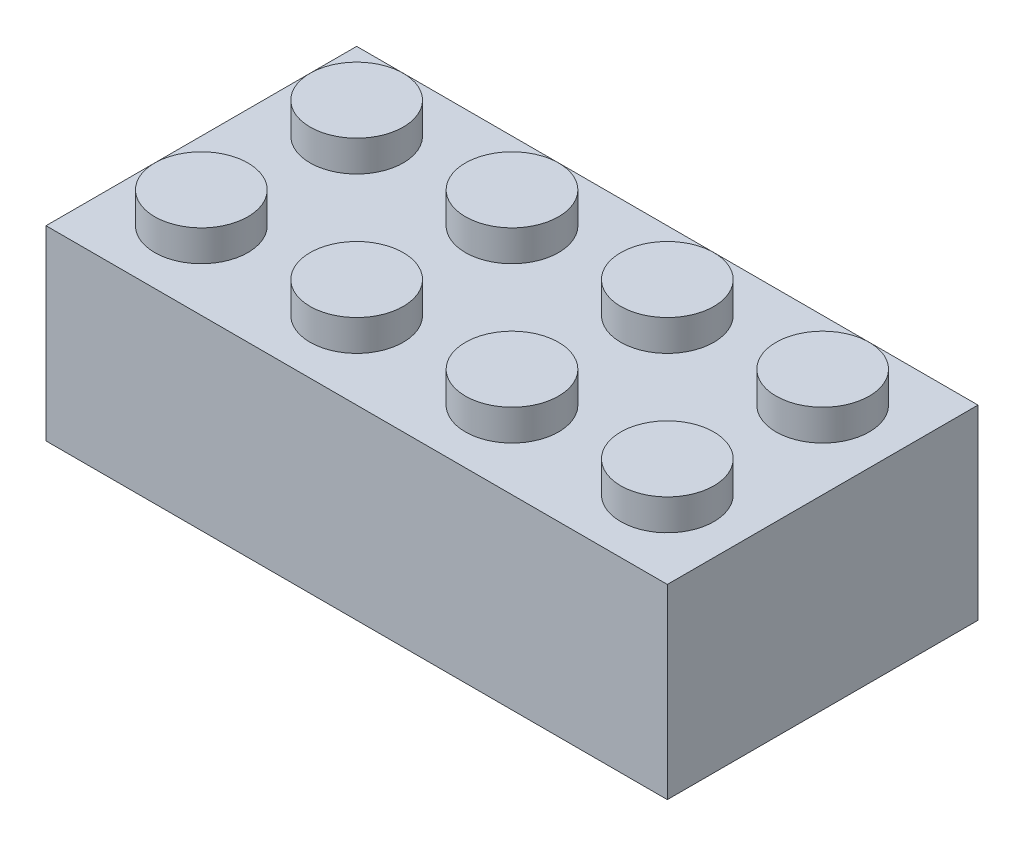
ISO-10303-21;
HEADER;
FILE_DESCRIPTION(('STEP AP214'),'2;1');
FILE_NAME('part.step','',(''),(''),'','','');
FILE_SCHEMA(('AUTOMOTIVE_DESIGN { 1 0 10303 214 1 1 1 1 }'));
ENDSEC;
DATA;
#1=APPLICATION_CONTEXT('core data for automotive mechanical design processes');
#2=APPLICATION_PROTOCOL_DEFINITION('international standard','automotive_design',2000,#1);
#3=PRODUCT_CONTEXT('',#1,'mechanical');
#4=PRODUCT('Part','Part','',(#3));
#5=PRODUCT_RELATED_PRODUCT_CATEGORY('part','',(#4));
#6=PRODUCT_DEFINITION_FORMATION('','',#4);
#7=PRODUCT_DEFINITION_CONTEXT('part definition',#1,'design');
#8=PRODUCT_DEFINITION('design','',#6,#7);
#9=PRODUCT_DEFINITION_SHAPE('','',#8);
#10=(LENGTH_UNIT() NAMED_UNIT(*) SI_UNIT(.MILLI.,.METRE.));
#11=(NAMED_UNIT(*) PLANE_ANGLE_UNIT() SI_UNIT($,.RADIAN.));
#12=(NAMED_UNIT(*) SI_UNIT($,.STERADIAN.) SOLID_ANGLE_UNIT());
#13=UNCERTAINTY_MEASURE_WITH_UNIT(LENGTH_MEASURE(1.E-05),#10,'distance_accuracy_value','');
#14=(GEOMETRIC_REPRESENTATION_CONTEXT(3) GLOBAL_UNCERTAINTY_ASSIGNED_CONTEXT((#13)) GLOBAL_UNIT_ASSIGNED_CONTEXT((#10,
#11,#12)) REPRESENTATION_CONTEXT('',''));
#15=CARTESIAN_POINT('',(0.,0.,0.));
#16=DIRECTION('',(0.,0.,1.));
#17=DIRECTION('',(1.,0.,0.));
#18=AXIS2_PLACEMENT_3D('',#15,#16,#17);
#19=CARTESIAN_POINT('',(-7.5,2.,-2.5));
#20=DIRECTION('',(0.,-1.,0.));
#21=DIRECTION('',(0.,0.,-1.));
#22=AXIS2_PLACEMENT_3D('',#19,#20,#21);
#23=CYLINDRICAL_SURFACE('',#22,1.5);
#24=CARTESIAN_POINT('',(-7.5,1.,-2.5));
#25=DIRECTION('',(0.,1.,0.));
#26=DIRECTION('',(0.,0.,1.));
#27=AXIS2_PLACEMENT_3D('',#24,#25,#26);
#28=CIRCLE('',#27,1.5);
#29=CARTESIAN_POINT('',(-7.5,1.,-1.));
#30=VERTEX_POINT('',#29);
#31=EDGE_CURVE('E307',#30,#30,#28,.T.);
#32=ORIENTED_EDGE('',*,*,#31,.T.);
#33=EDGE_LOOP('',(#32));
#34=FACE_BOUND('',#33,.T.);
#35=CARTESIAN_POINT('',(-7.5,2.,-2.5));
#36=DIRECTION('',(0.,1.,0.));
#37=DIRECTION('',(0.,0.,1.));
#38=AXIS2_PLACEMENT_3D('',#35,#36,#37);
#39=CIRCLE('',#38,1.5);
#40=CARTESIAN_POINT('',(-7.5,2.,-1.));
#41=VERTEX_POINT('',#40);
#42=EDGE_CURVE('E308',#41,#41,#39,.T.);
#43=ORIENTED_EDGE('',*,*,#42,.F.);
#44=EDGE_LOOP('',(#43));
#45=FACE_BOUND('',#44,.T.);
#46=ADVANCED_FACE('F80',(#34,#45),#23,.T.);
#47=CARTESIAN_POINT('',(0.,2.,0.));
#48=DIRECTION('',(0.,1.,0.));
#49=DIRECTION('',(0.,0.,1.));
#50=AXIS2_PLACEMENT_3D('',#47,#48,#49);
#51=PLANE('',#50);
#52=ORIENTED_EDGE('',*,*,#42,.T.);
#53=EDGE_LOOP('',(#52));
#54=FACE_BOUND('',#53,.T.);
#55=ADVANCED_FACE('F347',(#54),#51,.T.);
#56=CARTESIAN_POINT('',(-10.,1.,5.));
#57=DIRECTION('',(0.,0.,-1.));
#58=DIRECTION('',(-1.,0.,0.));
#59=AXIS2_PLACEMENT_3D('',#56,#57,#58);
#60=PLANE('',#59);
#61=DIRECTION('',(0.,-1.,0.));
#62=VECTOR('',#61,1.);
#63=CARTESIAN_POINT('',(-10.,1.,5.));
#64=LINE('',#63,#62);
#65=CARTESIAN_POINT('',(-10.,1.,5.));
#66=VERTEX_POINT('',#65);
#67=CARTESIAN_POINT('',(-10.,-5.,5.));
#68=VERTEX_POINT('',#67);
#69=EDGE_CURVE('E299',#66,#68,#64,.T.);
#70=ORIENTED_EDGE('',*,*,#69,.T.);
#71=DIRECTION('',(1.,0.,0.));
#72=VECTOR('',#71,1.);
#73=CARTESIAN_POINT('',(0.,-5.,5.));
#74=LINE('',#73,#72);
#75=CARTESIAN_POINT('',(10.,-5.,5.));
#76=VERTEX_POINT('',#75);
#77=EDGE_CURVE('E178',#68,#76,#74,.T.);
#78=ORIENTED_EDGE('',*,*,#77,.T.);
#79=DIRECTION('',(0.,-1.,0.));
#80=VECTOR('',#79,1.);
#81=CARTESIAN_POINT('',(10.,1.,5.));
#82=LINE('',#81,#80);
#83=CARTESIAN_POINT('',(10.,1.,5.));
#84=VERTEX_POINT('',#83);
#85=EDGE_CURVE('E305',#84,#76,#82,.T.);
#86=ORIENTED_EDGE('',*,*,#85,.F.);
#87=DIRECTION('',(1.,0.,0.));
#88=VECTOR('',#87,1.);
#89=CARTESIAN_POINT('',(-10.,1.,5.));
#90=LINE('',#89,#88);
#91=EDGE_CURVE('E288',#66,#84,#90,.T.);
#92=ORIENTED_EDGE('',*,*,#91,.F.);
#93=EDGE_LOOP('',(#70,#78,#86,#92));
#94=FACE_BOUND('',#93,.T.);
#95=ADVANCED_FACE('F352',(#94),#60,.F.);
#96=CARTESIAN_POINT('',(10.,1.,5.));
#97=DIRECTION('',(-1.,0.,0.));
#98=DIRECTION('',(0.,0.,1.));
#99=AXIS2_PLACEMENT_3D('',#96,#97,#98);
#100=PLANE('',#99);
#101=ORIENTED_EDGE('',*,*,#85,.T.);
#102=DIRECTION('',(0.,0.,-1.));
#103=VECTOR('',#102,1.);
#104=CARTESIAN_POINT('',(10.,-5.,0.));
#105=LINE('',#104,#103);
#106=CARTESIAN_POINT('',(10.,-5.,-5.));
#107=VERTEX_POINT('',#106);
#108=EDGE_CURVE('E181',#76,#107,#105,.T.);
#109=ORIENTED_EDGE('',*,*,#108,.T.);
#110=DIRECTION('',(0.,-1.,0.));
#111=VECTOR('',#110,1.);
#112=CARTESIAN_POINT('',(10.,1.,-5.));
#113=LINE('',#112,#111);
#114=CARTESIAN_POINT('',(10.,1.,-5.));
#115=VERTEX_POINT('',#114);
#116=EDGE_CURVE('E303',#115,#107,#113,.T.);
#117=ORIENTED_EDGE('',*,*,#116,.F.);
#118=DIRECTION('',(0.,0.,-1.));
#119=VECTOR('',#118,1.);
#120=CARTESIAN_POINT('',(10.,1.,5.));
#121=LINE('',#120,#119);
#122=EDGE_CURVE('E291',#84,#115,#121,.T.);
#123=ORIENTED_EDGE('',*,*,#122,.F.);
#124=EDGE_LOOP('',(#101,#109,#117,#123));
#125=FACE_BOUND('',#124,.T.);
#126=ADVANCED_FACE('F374',(#125),#100,.F.);
#127=CARTESIAN_POINT('',(-10.,1.,-5.));
#128=DIRECTION('',(0.,0.,-1.));
#129=DIRECTION('',(-1.,0.,0.));
#130=AXIS2_PLACEMENT_3D('',#127,#128,#129);
#131=PLANE('',#130);
#132=ORIENTED_EDGE('',*,*,#116,.T.);
#133=DIRECTION('',(1.,0.,0.));
#134=VECTOR('',#133,1.);
#135=CARTESIAN_POINT('',(0.,-5.,-5.));
#136=LINE('',#135,#134);
#137=CARTESIAN_POINT('',(-10.,-5.,-5.));
#138=VERTEX_POINT('',#137);
#139=EDGE_CURVE('E184',#138,#107,#136,.T.);
#140=ORIENTED_EDGE('',*,*,#139,.F.);
#141=DIRECTION('',(0.,-1.,0.));
#142=VECTOR('',#141,1.);
#143=CARTESIAN_POINT('',(-10.,1.,-5.));
#144=LINE('',#143,#142);
#145=CARTESIAN_POINT('',(-10.,1.,-5.));
#146=VERTEX_POINT('',#145);
#147=EDGE_CURVE('E301',#146,#138,#144,.T.);
#148=ORIENTED_EDGE('',*,*,#147,.F.);
#149=DIRECTION('',(1.,0.,0.));
#150=VECTOR('',#149,1.);
#151=CARTESIAN_POINT('',(-10.,1.,-5.));
#152=LINE('',#151,#150);
#153=EDGE_CURVE('E293',#146,#115,#152,.T.);
#154=ORIENTED_EDGE('',*,*,#153,.T.);
#155=EDGE_LOOP('',(#132,#140,#148,#154));
#156=FACE_BOUND('',#155,.T.);
#157=ADVANCED_FACE('F378',(#156),#131,.T.);
#158=CARTESIAN_POINT('',(-10.,1.,5.));
#159=DIRECTION('',(-1.,0.,0.));
#160=DIRECTION('',(0.,0.,1.));
#161=AXIS2_PLACEMENT_3D('',#158,#159,#160);
#162=PLANE('',#161);
#163=ORIENTED_EDGE('',*,*,#147,.T.);
#164=DIRECTION('',(0.,0.,-1.));
#165=VECTOR('',#164,1.);
#166=CARTESIAN_POINT('',(-10.,-5.,0.));
#167=LINE('',#166,#165);
#168=EDGE_CURVE('E164',#68,#138,#167,.T.);
#169=ORIENTED_EDGE('',*,*,#168,.F.);
#170=ORIENTED_EDGE('',*,*,#69,.F.);
#171=DIRECTION('',(0.,0.,-1.));
#172=VECTOR('',#171,1.);
#173=CARTESIAN_POINT('',(-10.,1.,5.));
#174=LINE('',#173,#172);
#175=EDGE_CURVE('E296',#66,#146,#174,.T.);
#176=ORIENTED_EDGE('',*,*,#175,.T.);
#177=EDGE_LOOP('',(#163,#169,#170,#176));
#178=FACE_BOUND('',#177,.T.);
#179=ADVANCED_FACE('F362',(#178),#162,.T.);
#180=CARTESIAN_POINT('',(0.,1.,0.));
#181=DIRECTION('',(0.,1.,0.));
#182=DIRECTION('',(0.,0.,1.));
#183=AXIS2_PLACEMENT_3D('',#180,#181,#182);
#184=PLANE('',#183);
#185=CARTESIAN_POINT('',(-7.49999999999995,1.,2.5));
#186=DIRECTION('',(0.,1.,0.));
#187=DIRECTION('',(0.,0.,1.));
#188=AXIS2_PLACEMENT_3D('',#185,#186,#187);
#189=CIRCLE('',#188,1.5);
#190=CARTESIAN_POINT('',(-7.49999999999995,1.,4.));
#191=VERTEX_POINT('',#190);
#192=EDGE_CURVE('E249',#191,#191,#189,.F.);
#193=ORIENTED_EDGE('',*,*,#192,.T.);
#194=EDGE_LOOP('',(#193));
#195=FACE_BOUND('',#194,.T.);
#196=CARTESIAN_POINT('',(-2.49999999999995,1.,2.5));
#197=DIRECTION('',(0.,1.,0.));
#198=DIRECTION('',(0.,0.,1.));
#199=AXIS2_PLACEMENT_3D('',#196,#197,#198);
#200=CIRCLE('',#199,1.5);
#201=CARTESIAN_POINT('',(-2.49999999999995,1.,4.));
#202=VERTEX_POINT('',#201);
#203=EDGE_CURVE('E255',#202,#202,#200,.F.);
#204=ORIENTED_EDGE('',*,*,#203,.T.);
#205=EDGE_LOOP('',(#204));
#206=FACE_BOUND('',#205,.T.);
#207=CARTESIAN_POINT('',(2.50000000000005,1.,2.5));
#208=DIRECTION('',(0.,1.,0.));
#209=DIRECTION('',(0.,0.,1.));
#210=AXIS2_PLACEMENT_3D('',#207,#208,#209);
#211=CIRCLE('',#210,1.5);
#212=CARTESIAN_POINT('',(2.50000000000005,1.,4.));
#213=VERTEX_POINT('',#212);
#214=EDGE_CURVE('E261',#213,#213,#211,.F.);
#215=ORIENTED_EDGE('',*,*,#214,.T.);
#216=EDGE_LOOP('',(#215));
#217=FACE_BOUND('',#216,.T.);
#218=CARTESIAN_POINT('',(7.50000000000005,1.,2.5));
#219=DIRECTION('',(0.,1.,0.));
#220=DIRECTION('',(0.,0.,1.));
#221=AXIS2_PLACEMENT_3D('',#218,#219,#220);
#222=CIRCLE('',#221,1.5);
#223=CARTESIAN_POINT('',(7.50000000000005,1.,4.));
#224=VERTEX_POINT('',#223);
#225=EDGE_CURVE('E267',#224,#224,#222,.F.);
#226=ORIENTED_EDGE('',*,*,#225,.T.);
#227=EDGE_LOOP('',(#226));
#228=FACE_BOUND('',#227,.T.);
#229=CARTESIAN_POINT('',(7.5,1.,-2.5));
#230=DIRECTION('',(0.,1.,0.));
#231=DIRECTION('',(0.,0.,1.));
#232=AXIS2_PLACEMENT_3D('',#229,#230,#231);
#233=CIRCLE('',#232,1.5);
#234=CARTESIAN_POINT('',(7.5,1.,-1.));
#235=VERTEX_POINT('',#234);
#236=EDGE_CURVE('E273',#235,#235,#233,.F.);
#237=ORIENTED_EDGE('',*,*,#236,.T.);
#238=EDGE_LOOP('',(#237));
#239=FACE_BOUND('',#238,.T.);
#240=CARTESIAN_POINT('',(2.5,1.,-2.5));
#241=DIRECTION('',(0.,1.,0.));
#242=DIRECTION('',(0.,0.,1.));
#243=AXIS2_PLACEMENT_3D('',#240,#241,#242);
#244=CIRCLE('',#243,1.5);
#245=CARTESIAN_POINT('',(2.5,1.,-1.));
#246=VERTEX_POINT('',#245);
#247=EDGE_CURVE('E279',#246,#246,#244,.F.);
#248=ORIENTED_EDGE('',*,*,#247,.T.);
#249=EDGE_LOOP('',(#248));
#250=FACE_BOUND('',#249,.T.);
#251=CARTESIAN_POINT('',(-2.5,1.,-2.5));
#252=DIRECTION('',(0.,1.,0.));
#253=DIRECTION('',(0.,0.,1.));
#254=AXIS2_PLACEMENT_3D('',#251,#252,#253);
#255=CIRCLE('',#254,1.5);
#256=CARTESIAN_POINT('',(-2.5,1.,-1.));
#257=VERTEX_POINT('',#256);
#258=EDGE_CURVE('E285',#257,#257,#255,.F.);
#259=ORIENTED_EDGE('',*,*,#258,.T.);
#260=EDGE_LOOP('',(#259));
#261=FACE_BOUND('',#260,.T.);
#262=ORIENTED_EDGE('',*,*,#31,.F.);
#263=EDGE_LOOP('',(#262));
#264=FACE_BOUND('',#263,.T.);
#265=ORIENTED_EDGE('',*,*,#91,.T.);
#266=ORIENTED_EDGE('',*,*,#122,.T.);
#267=ORIENTED_EDGE('',*,*,#153,.F.);
#268=ORIENTED_EDGE('',*,*,#175,.F.);
#269=EDGE_LOOP('',(#265,#266,#267,#268));
#270=FACE_BOUND('',#269,.T.);
#271=ADVANCED_FACE('F358',(#195,#206,#217,#228,#239,#250,#261,#264,#270),#184,.T.);
#272=CARTESIAN_POINT('',(-2.5,2.,-2.5));
#273=DIRECTION('',(0.,-1.,0.));
#274=DIRECTION('',(0.,0.,-1.));
#275=AXIS2_PLACEMENT_3D('',#272,#273,#274);
#276=CYLINDRICAL_SURFACE('',#275,1.5);
#277=ORIENTED_EDGE('',*,*,#258,.F.);
#278=EDGE_LOOP('',(#277));
#279=FACE_BOUND('',#278,.T.);
#280=CARTESIAN_POINT('',(-2.5,2.,-2.5));
#281=DIRECTION('',(0.,1.,0.));
#282=DIRECTION('',(0.,0.,1.));
#283=AXIS2_PLACEMENT_3D('',#280,#281,#282);
#284=CIRCLE('',#283,1.5);
#285=CARTESIAN_POINT('',(-2.5,2.,-1.));
#286=VERTEX_POINT('',#285);
#287=EDGE_CURVE('E282',#286,#286,#284,.T.);
#288=ORIENTED_EDGE('',*,*,#287,.F.);
#289=EDGE_LOOP('',(#288));
#290=FACE_BOUND('',#289,.T.);
#291=ADVANCED_FACE('F361',(#279,#290),#276,.T.);
#292=CARTESIAN_POINT('',(0.,2.,0.));
#293=DIRECTION('',(0.,1.,0.));
#294=DIRECTION('',(0.,0.,1.));
#295=AXIS2_PLACEMENT_3D('',#292,#293,#294);
#296=PLANE('',#295);
#297=ORIENTED_EDGE('',*,*,#287,.T.);
#298=EDGE_LOOP('',(#297));
#299=FACE_BOUND('',#298,.T.);
#300=ADVANCED_FACE('F819',(#299),#296,.T.);
#301=CARTESIAN_POINT('',(2.5,2.,-2.5));
#302=DIRECTION('',(0.,-1.,0.));
#303=DIRECTION('',(0.,0.,-1.));
#304=AXIS2_PLACEMENT_3D('',#301,#302,#303);
#305=CYLINDRICAL_SURFACE('',#304,1.5);
#306=ORIENTED_EDGE('',*,*,#247,.F.);
#307=EDGE_LOOP('',(#306));
#308=FACE_BOUND('',#307,.T.);
#309=CARTESIAN_POINT('',(2.5,2.,-2.5));
#310=DIRECTION('',(0.,1.,0.));
#311=DIRECTION('',(0.,0.,1.));
#312=AXIS2_PLACEMENT_3D('',#309,#310,#311);
#313=CIRCLE('',#312,1.5);
#314=CARTESIAN_POINT('',(2.5,2.,-1.));
#315=VERTEX_POINT('',#314);
#316=EDGE_CURVE('E276',#315,#315,#313,.T.);
#317=ORIENTED_EDGE('',*,*,#316,.F.);
#318=EDGE_LOOP('',(#317));
#319=FACE_BOUND('',#318,.T.);
#320=ADVANCED_FACE('F811',(#308,#319),#305,.T.);
#321=CARTESIAN_POINT('',(0.,2.,0.));
#322=DIRECTION('',(0.,1.,0.));
#323=DIRECTION('',(0.,0.,1.));
#324=AXIS2_PLACEMENT_3D('',#321,#322,#323);
#325=PLANE('',#324);
#326=ORIENTED_EDGE('',*,*,#316,.T.);
#327=EDGE_LOOP('',(#326));
#328=FACE_BOUND('',#327,.T.);
#329=ADVANCED_FACE('F803',(#328),#325,.T.);
#330=CARTESIAN_POINT('',(7.5,2.,-2.5));
#331=DIRECTION('',(0.,-1.,0.));
#332=DIRECTION('',(0.,0.,-1.));
#333=AXIS2_PLACEMENT_3D('',#330,#331,#332);
#334=CYLINDRICAL_SURFACE('',#333,1.5);
#335=ORIENTED_EDGE('',*,*,#236,.F.);
#336=EDGE_LOOP('',(#335));
#337=FACE_BOUND('',#336,.T.);
#338=CARTESIAN_POINT('',(7.5,2.,-2.5));
#339=DIRECTION('',(0.,1.,0.));
#340=DIRECTION('',(0.,0.,1.));
#341=AXIS2_PLACEMENT_3D('',#338,#339,#340);
#342=CIRCLE('',#341,1.5);
#343=CARTESIAN_POINT('',(7.5,2.,-1.));
#344=VERTEX_POINT('',#343);
#345=EDGE_CURVE('E270',#344,#344,#342,.T.);
#346=ORIENTED_EDGE('',*,*,#345,.F.);
#347=EDGE_LOOP('',(#346));
#348=FACE_BOUND('',#347,.T.);
#349=ADVANCED_FACE('F795',(#337,#348),#334,.T.);
#350=CARTESIAN_POINT('',(0.,2.,0.));
#351=DIRECTION('',(0.,1.,0.));
#352=DIRECTION('',(0.,0.,1.));
#353=AXIS2_PLACEMENT_3D('',#350,#351,#352);
#354=PLANE('',#353);
#355=ORIENTED_EDGE('',*,*,#345,.T.);
#356=EDGE_LOOP('',(#355));
#357=FACE_BOUND('',#356,.T.);
#358=ADVANCED_FACE('F787',(#357),#354,.T.);
#359=CARTESIAN_POINT('',(7.50000000000005,2.,2.5));
#360=DIRECTION('',(0.,-1.,0.));
#361=DIRECTION('',(0.,0.,-1.));
#362=AXIS2_PLACEMENT_3D('',#359,#360,#361);
#363=CYLINDRICAL_SURFACE('',#362,1.5);
#364=ORIENTED_EDGE('',*,*,#225,.F.);
#365=EDGE_LOOP('',(#364));
#366=FACE_BOUND('',#365,.T.);
#367=CARTESIAN_POINT('',(7.50000000000005,2.,2.5));
#368=DIRECTION('',(0.,1.,0.));
#369=DIRECTION('',(0.,0.,1.));
#370=AXIS2_PLACEMENT_3D('',#367,#368,#369);
#371=CIRCLE('',#370,1.5);
#372=CARTESIAN_POINT('',(7.50000000000005,2.,4.));
#373=VERTEX_POINT('',#372);
#374=EDGE_CURVE('E264',#373,#373,#371,.T.);
#375=ORIENTED_EDGE('',*,*,#374,.F.);
#376=EDGE_LOOP('',(#375));
#377=FACE_BOUND('',#376,.T.);
#378=ADVANCED_FACE('F779',(#366,#377),#363,.T.);
#379=CARTESIAN_POINT('',(0.,2.,0.));
#380=DIRECTION('',(0.,1.,0.));
#381=DIRECTION('',(0.,0.,1.));
#382=AXIS2_PLACEMENT_3D('',#379,#380,#381);
#383=PLANE('',#382);
#384=ORIENTED_EDGE('',*,*,#374,.T.);
#385=EDGE_LOOP('',(#384));
#386=FACE_BOUND('',#385,.T.);
#387=ADVANCED_FACE('F771',(#386),#383,.T.);
#388=CARTESIAN_POINT('',(2.50000000000005,2.,2.5));
#389=DIRECTION('',(0.,-1.,0.));
#390=DIRECTION('',(0.,0.,-1.));
#391=AXIS2_PLACEMENT_3D('',#388,#389,#390);
#392=CYLINDRICAL_SURFACE('',#391,1.5);
#393=ORIENTED_EDGE('',*,*,#214,.F.);
#394=EDGE_LOOP('',(#393));
#395=FACE_BOUND('',#394,.T.);
#396=CARTESIAN_POINT('',(2.50000000000005,2.,2.5));
#397=DIRECTION('',(0.,1.,0.));
#398=DIRECTION('',(0.,0.,1.));
#399=AXIS2_PLACEMENT_3D('',#396,#397,#398);
#400=CIRCLE('',#399,1.5);
#401=CARTESIAN_POINT('',(2.50000000000005,2.,4.));
#402=VERTEX_POINT('',#401);
#403=EDGE_CURVE('E258',#402,#402,#400,.T.);
#404=ORIENTED_EDGE('',*,*,#403,.F.);
#405=EDGE_LOOP('',(#404));
#406=FACE_BOUND('',#405,.T.);
#407=ADVANCED_FACE('F763',(#395,#406),#392,.T.);
#408=CARTESIAN_POINT('',(0.,2.,0.));
#409=DIRECTION('',(0.,1.,0.));
#410=DIRECTION('',(0.,0.,1.));
#411=AXIS2_PLACEMENT_3D('',#408,#409,#410);
#412=PLANE('',#411);
#413=ORIENTED_EDGE('',*,*,#403,.T.);
#414=EDGE_LOOP('',(#413));
#415=FACE_BOUND('',#414,.T.);
#416=ADVANCED_FACE('F755',(#415),#412,.T.);
#417=CARTESIAN_POINT('',(-2.49999999999995,2.,2.5));
#418=DIRECTION('',(0.,-1.,0.));
#419=DIRECTION('',(0.,0.,-1.));
#420=AXIS2_PLACEMENT_3D('',#417,#418,#419);
#421=CYLINDRICAL_SURFACE('',#420,1.5);
#422=ORIENTED_EDGE('',*,*,#203,.F.);
#423=EDGE_LOOP('',(#422));
#424=FACE_BOUND('',#423,.T.);
#425=CARTESIAN_POINT('',(-2.49999999999995,2.,2.5));
#426=DIRECTION('',(0.,1.,0.));
#427=DIRECTION('',(0.,0.,1.));
#428=AXIS2_PLACEMENT_3D('',#425,#426,#427);
#429=CIRCLE('',#428,1.5);
#430=CARTESIAN_POINT('',(-2.49999999999995,2.,4.));
#431=VERTEX_POINT('',#430);
#432=EDGE_CURVE('E252',#431,#431,#429,.T.);
#433=ORIENTED_EDGE('',*,*,#432,.F.);
#434=EDGE_LOOP('',(#433));
#435=FACE_BOUND('',#434,.T.);
#436=ADVANCED_FACE('F747',(#424,#435),#421,.T.);
#437=CARTESIAN_POINT('',(0.,2.,0.));
#438=DIRECTION('',(0.,1.,0.));
#439=DIRECTION('',(0.,0.,1.));
#440=AXIS2_PLACEMENT_3D('',#437,#438,#439);
#441=PLANE('',#440);
#442=ORIENTED_EDGE('',*,*,#432,.T.);
#443=EDGE_LOOP('',(#442));
#444=FACE_BOUND('',#443,.T.);
#445=ADVANCED_FACE('F739',(#444),#441,.T.);
#446=CARTESIAN_POINT('',(-7.49999999999995,2.,2.5));
#447=DIRECTION('',(0.,-1.,0.));
#448=DIRECTION('',(0.,0.,-1.));
#449=AXIS2_PLACEMENT_3D('',#446,#447,#448);
#450=CYLINDRICAL_SURFACE('',#449,1.5);
#451=ORIENTED_EDGE('',*,*,#192,.F.);
#452=EDGE_LOOP('',(#451));
#453=FACE_BOUND('',#452,.T.);
#454=CARTESIAN_POINT('',(-7.49999999999995,2.,2.5));
#455=DIRECTION('',(0.,1.,0.));
#456=DIRECTION('',(0.,0.,1.));
#457=AXIS2_PLACEMENT_3D('',#454,#455,#456);
#458=CIRCLE('',#457,1.5);
#459=CARTESIAN_POINT('',(-7.49999999999995,2.,4.));
#460=VERTEX_POINT('',#459);
#461=EDGE_CURVE('E244',#460,#460,#458,.T.);
#462=ORIENTED_EDGE('',*,*,#461,.F.);
#463=EDGE_LOOP('',(#462));
#464=FACE_BOUND('',#463,.T.);
#465=ADVANCED_FACE('F732',(#453,#464),#450,.T.);
#466=CARTESIAN_POINT('',(0.,2.,0.));
#467=DIRECTION('',(0.,1.,0.));
#468=DIRECTION('',(0.,0.,1.));
#469=AXIS2_PLACEMENT_3D('',#466,#467,#468);
#470=PLANE('',#469);
#471=ORIENTED_EDGE('',*,*,#461,.T.);
#472=EDGE_LOOP('',(#471));
#473=FACE_BOUND('',#472,.T.);
#474=ADVANCED_FACE('F422',(#473),#470,.T.);
#475=CARTESIAN_POINT('',(9.00000000000001,-5.,0.));
#476=DIRECTION('',(1.,0.,0.));
#477=DIRECTION('',(0.,0.,-1.));
#478=AXIS2_PLACEMENT_3D('',#475,#476,#477);
#479=PLANE('',#478);
#480=DIRECTION('',(0.,0.,-1.));
#481=VECTOR('',#480,1.);
#482=CARTESIAN_POINT('',(9.00000000000001,0.,0.));
#483=LINE('',#482,#481);
#484=CARTESIAN_POINT('',(9.00000000000001,0.,4.));
#485=VERTEX_POINT('',#484);
#486=CARTESIAN_POINT('',(9.00000000000001,0.,-4.));
#487=VERTEX_POINT('',#486);
#488=EDGE_CURVE('E189',#485,#487,#483,.T.);
#489=ORIENTED_EDGE('',*,*,#488,.T.);
#490=DIRECTION('',(0.,1.,0.));
#491=VECTOR('',#490,1.);
#492=CARTESIAN_POINT('',(9.00000000000001,-5.,-4.));
#493=LINE('',#492,#491);
#494=CARTESIAN_POINT('',(9.00000000000001,-5.,-4.));
#495=VERTEX_POINT('',#494);
#496=EDGE_CURVE('E167',#495,#487,#493,.T.);
#497=ORIENTED_EDGE('',*,*,#496,.F.);
#498=DIRECTION('',(0.,0.,-1.));
#499=VECTOR('',#498,1.);
#500=CARTESIAN_POINT('',(9.00000000000001,-5.,0.));
#501=LINE('',#500,#499);
#502=CARTESIAN_POINT('',(9.00000000000001,-5.,4.));
#503=VERTEX_POINT('',#502);
#504=EDGE_CURVE('E149',#503,#495,#501,.T.);
#505=ORIENTED_EDGE('',*,*,#504,.F.);
#506=DIRECTION('',(0.,1.,0.));
#507=VECTOR('',#506,1.);
#508=CARTESIAN_POINT('',(9.00000000000001,-5.,4.));
#509=LINE('',#508,#507);
#510=EDGE_CURVE('E158',#503,#485,#509,.T.);
#511=ORIENTED_EDGE('',*,*,#510,.T.);
#512=EDGE_LOOP('',(#489,#497,#505,#511));
#513=FACE_BOUND('',#512,.T.);
#514=ADVANCED_FACE('F166',(#513),#479,.F.);
#515=CARTESIAN_POINT('',(0.,-5.,-4.));
#516=DIRECTION('',(0.,0.,1.));
#517=DIRECTION('',(1.,0.,0.));
#518=AXIS2_PLACEMENT_3D('',#515,#516,#517);
#519=PLANE('',#518);
#520=DIRECTION('',(1.,0.,0.));
#521=VECTOR('',#520,1.);
#522=CARTESIAN_POINT('',(0.,0.,-4.));
#523=LINE('',#522,#521);
#524=CARTESIAN_POINT('',(-9.,0.,-4.));
#525=VERTEX_POINT('',#524);
#526=EDGE_CURVE('E94',#525,#487,#523,.T.);
#527=ORIENTED_EDGE('',*,*,#526,.F.);
#528=DIRECTION('',(0.,1.,0.));
#529=VECTOR('',#528,1.);
#530=CARTESIAN_POINT('',(-9.,-5.,-4.));
#531=LINE('',#530,#529);
#532=CARTESIAN_POINT('',(-9.,-5.,-4.));
#533=VERTEX_POINT('',#532);
#534=EDGE_CURVE('E196',#533,#525,#531,.T.);
#535=ORIENTED_EDGE('',*,*,#534,.F.);
#536=DIRECTION('',(1.,0.,0.));
#537=VECTOR('',#536,1.);
#538=CARTESIAN_POINT('',(0.,-5.,-4.));
#539=LINE('',#538,#537);
#540=EDGE_CURVE('E176',#533,#495,#539,.T.);
#541=ORIENTED_EDGE('',*,*,#540,.T.);
#542=ORIENTED_EDGE('',*,*,#496,.T.);
#543=EDGE_LOOP('',(#527,#535,#541,#542));
#544=FACE_BOUND('',#543,.T.);
#545=ADVANCED_FACE('F421',(#544),#519,.T.);
#546=CARTESIAN_POINT('',(-9.,-5.,0.));
#547=DIRECTION('',(1.,0.,0.));
#548=DIRECTION('',(0.,0.,-1.));
#549=AXIS2_PLACEMENT_3D('',#546,#547,#548);
#550=PLANE('',#549);
#551=DIRECTION('',(0.,0.,-1.));
#552=VECTOR('',#551,1.);
#553=CARTESIAN_POINT('',(-9.,0.,0.));
#554=LINE('',#553,#552);
#555=CARTESIAN_POINT('',(-9.,0.,4.));
#556=VERTEX_POINT('',#555);
#557=EDGE_CURVE('E99',#556,#525,#554,.T.);
#558=ORIENTED_EDGE('',*,*,#557,.F.);
#559=DIRECTION('',(0.,1.,0.));
#560=VECTOR('',#559,1.);
#561=CARTESIAN_POINT('',(-9.,-5.,4.));
#562=LINE('',#561,#560);
#563=CARTESIAN_POINT('',(-9.,-5.,4.));
#564=VERTEX_POINT('',#563);
#565=EDGE_CURVE('E163',#564,#556,#562,.T.);
#566=ORIENTED_EDGE('',*,*,#565,.F.);
#567=DIRECTION('',(0.,0.,-1.));
#568=VECTOR('',#567,1.);
#569=CARTESIAN_POINT('',(-9.,-5.,0.));
#570=LINE('',#569,#568);
#571=EDGE_CURVE('E152',#564,#533,#570,.T.);
#572=ORIENTED_EDGE('',*,*,#571,.T.);
#573=ORIENTED_EDGE('',*,*,#534,.T.);
#574=EDGE_LOOP('',(#558,#566,#572,#573));
#575=FACE_BOUND('',#574,.T.);
#576=ADVANCED_FACE('F431',(#575),#550,.T.);
#577=CARTESIAN_POINT('',(0.,-5.,4.));
#578=DIRECTION('',(0.,0.,1.));
#579=DIRECTION('',(1.,0.,0.));
#580=AXIS2_PLACEMENT_3D('',#577,#578,#579);
#581=PLANE('',#580);
#582=DIRECTION('',(1.,0.,0.));
#583=VECTOR('',#582,1.);
#584=CARTESIAN_POINT('',(0.,0.,4.));
#585=LINE('',#584,#583);
#586=EDGE_CURVE('E160',#556,#485,#585,.T.);
#587=ORIENTED_EDGE('',*,*,#586,.T.);
#588=ORIENTED_EDGE('',*,*,#510,.F.);
#589=DIRECTION('',(1.,0.,0.));
#590=VECTOR('',#589,1.);
#591=CARTESIAN_POINT('',(0.,-5.,4.));
#592=LINE('',#591,#590);
#593=EDGE_CURVE('E143',#564,#503,#592,.T.);
#594=ORIENTED_EDGE('',*,*,#593,.F.);
#595=ORIENTED_EDGE('',*,*,#565,.T.);
#596=EDGE_LOOP('',(#587,#588,#594,#595));
#597=FACE_BOUND('',#596,.T.);
#598=ADVANCED_FACE('F159',(#597),#581,.F.);
#599=CARTESIAN_POINT('',(0.,-5.,0.));
#600=DIRECTION('',(0.,1.,0.));
#601=DIRECTION('',(0.,0.,1.));
#602=AXIS2_PLACEMENT_3D('',#599,#600,#601);
#603=PLANE('',#602);
#604=ORIENTED_EDGE('',*,*,#504,.T.);
#605=ORIENTED_EDGE('',*,*,#540,.F.);
#606=ORIENTED_EDGE('',*,*,#571,.F.);
#607=ORIENTED_EDGE('',*,*,#593,.T.);
#608=EDGE_LOOP('',(#604,#605,#606,#607));
#609=FACE_BOUND('',#608,.T.);
#610=ORIENTED_EDGE('',*,*,#77,.F.);
#611=ORIENTED_EDGE('',*,*,#168,.T.);
#612=ORIENTED_EDGE('',*,*,#139,.T.);
#613=ORIENTED_EDGE('',*,*,#108,.F.);
#614=EDGE_LOOP('',(#610,#611,#612,#613));
#615=FACE_BOUND('',#614,.T.);
#616=ADVANCED_FACE('F145',(#609,#615),#603,.F.);
#617=CARTESIAN_POINT('',(0.,1.,0.));
#618=DIRECTION('',(0.,1.,0.));
#619=DIRECTION('',(0.,0.,1.));
#620=AXIS2_PLACEMENT_3D('',#617,#618,#619);
#621=PLANE('',#620);
#622=CARTESIAN_POINT('',(-2.49999999999995,1.,2.5));
#623=DIRECTION('',(0.,1.,0.));
#624=DIRECTION('',(0.,0.,1.));
#625=AXIS2_PLACEMENT_3D('',#622,#623,#624);
#626=CIRCLE('',#625,0.75);
#627=CARTESIAN_POINT('',(-2.49999999999995,1.,3.25));
#628=VERTEX_POINT('',#627);
#629=EDGE_CURVE('E199',#628,#628,#626,.T.);
#630=ORIENTED_EDGE('',*,*,#629,.F.);
#631=EDGE_LOOP('',(#630));
#632=FACE_BOUND('',#631,.T.);
#633=ADVANCED_FACE('F458',(#632),#621,.F.);
#634=CARTESIAN_POINT('',(0.,1.,0.));
#635=DIRECTION('',(0.,1.,0.));
#636=DIRECTION('',(0.,0.,1.));
#637=AXIS2_PLACEMENT_3D('',#634,#635,#636);
#638=PLANE('',#637);
#639=CARTESIAN_POINT('',(2.50000000000005,1.,2.5));
#640=DIRECTION('',(0.,1.,0.));
#641=DIRECTION('',(0.,0.,1.));
#642=AXIS2_PLACEMENT_3D('',#639,#640,#641);
#643=CIRCLE('',#642,0.75);
#644=CARTESIAN_POINT('',(2.50000000000005,1.,3.25));
#645=VERTEX_POINT('',#644);
#646=EDGE_CURVE('E206',#645,#645,#643,.T.);
#647=ORIENTED_EDGE('',*,*,#646,.F.);
#648=EDGE_LOOP('',(#647));
#649=FACE_BOUND('',#648,.T.);
#650=ADVANCED_FACE('F683',(#649),#638,.F.);
#651=CARTESIAN_POINT('',(0.,1.,0.));
#652=DIRECTION('',(0.,1.,0.));
#653=DIRECTION('',(0.,0.,1.));
#654=AXIS2_PLACEMENT_3D('',#651,#652,#653);
#655=PLANE('',#654);
#656=CARTESIAN_POINT('',(7.50000000000005,1.,2.5));
#657=DIRECTION('',(0.,1.,0.));
#658=DIRECTION('',(0.,0.,1.));
#659=AXIS2_PLACEMENT_3D('',#656,#657,#658);
#660=CIRCLE('',#659,0.75);
#661=CARTESIAN_POINT('',(7.50000000000005,1.,3.25));
#662=VERTEX_POINT('',#661);
#663=EDGE_CURVE('E212',#662,#662,#660,.T.);
#664=ORIENTED_EDGE('',*,*,#663,.F.);
#665=EDGE_LOOP('',(#664));
#666=FACE_BOUND('',#665,.T.);
#667=ADVANCED_FACE('F665',(#666),#655,.F.);
#668=CARTESIAN_POINT('',(0.,1.,0.));
#669=DIRECTION('',(0.,1.,0.));
#670=DIRECTION('',(0.,0.,1.));
#671=AXIS2_PLACEMENT_3D('',#668,#669,#670);
#672=PLANE('',#671);
#673=CARTESIAN_POINT('',(7.5,1.,-2.5));
#674=DIRECTION('',(0.,1.,0.));
#675=DIRECTION('',(0.,0.,1.));
#676=AXIS2_PLACEMENT_3D('',#673,#674,#675);
#677=CIRCLE('',#676,0.75);
#678=CARTESIAN_POINT('',(7.5,1.,-1.75));
#679=VERTEX_POINT('',#678);
#680=EDGE_CURVE('E218',#679,#679,#677,.T.);
#681=ORIENTED_EDGE('',*,*,#680,.F.);
#682=EDGE_LOOP('',(#681));
#683=FACE_BOUND('',#682,.T.);
#684=ADVANCED_FACE('F647',(#683),#672,.F.);
#685=CARTESIAN_POINT('',(0.,1.,0.));
#686=DIRECTION('',(0.,1.,0.));
#687=DIRECTION('',(0.,0.,1.));
#688=AXIS2_PLACEMENT_3D('',#685,#686,#687);
#689=PLANE('',#688);
#690=CARTESIAN_POINT('',(2.5,1.,-2.5));
#691=DIRECTION('',(0.,1.,0.));
#692=DIRECTION('',(0.,0.,1.));
#693=AXIS2_PLACEMENT_3D('',#690,#691,#692);
#694=CIRCLE('',#693,0.75);
#695=CARTESIAN_POINT('',(2.5,1.,-1.75));
#696=VERTEX_POINT('',#695);
#697=EDGE_CURVE('E224',#696,#696,#694,.T.);
#698=ORIENTED_EDGE('',*,*,#697,.F.);
#699=EDGE_LOOP('',(#698));
#700=FACE_BOUND('',#699,.T.);
#701=ADVANCED_FACE('F629',(#700),#689,.F.);
#702=CARTESIAN_POINT('',(0.,1.,0.));
#703=DIRECTION('',(0.,1.,0.));
#704=DIRECTION('',(0.,0.,1.));
#705=AXIS2_PLACEMENT_3D('',#702,#703,#704);
#706=PLANE('',#705);
#707=CARTESIAN_POINT('',(-2.5,1.,-2.5));
#708=DIRECTION('',(0.,1.,0.));
#709=DIRECTION('',(0.,0.,1.));
#710=AXIS2_PLACEMENT_3D('',#707,#708,#709);
#711=CIRCLE('',#710,0.75);
#712=CARTESIAN_POINT('',(-2.5,1.,-1.75));
#713=VERTEX_POINT('',#712);
#714=EDGE_CURVE('E230',#713,#713,#711,.T.);
#715=ORIENTED_EDGE('',*,*,#714,.F.);
#716=EDGE_LOOP('',(#715));
#717=FACE_BOUND('',#716,.T.);
#718=ADVANCED_FACE('F611',(#717),#706,.F.);
#719=CARTESIAN_POINT('',(0.,1.,0.));
#720=DIRECTION('',(0.,1.,0.));
#721=DIRECTION('',(0.,0.,1.));
#722=AXIS2_PLACEMENT_3D('',#719,#720,#721);
#723=PLANE('',#722);
#724=CARTESIAN_POINT('',(-7.5,1.,-2.5));
#725=DIRECTION('',(0.,1.,0.));
#726=DIRECTION('',(0.,0.,1.));
#727=AXIS2_PLACEMENT_3D('',#724,#725,#726);
#728=CIRCLE('',#727,0.75);
#729=CARTESIAN_POINT('',(-7.5,1.,-1.75));
#730=VERTEX_POINT('',#729);
#731=EDGE_CURVE('E236',#730,#730,#728,.T.);
#732=ORIENTED_EDGE('',*,*,#731,.F.);
#733=EDGE_LOOP('',(#732));
#734=FACE_BOUND('',#733,.T.);
#735=ADVANCED_FACE('F593',(#734),#723,.F.);
#736=CARTESIAN_POINT('',(0.,1.,0.));
#737=DIRECTION('',(0.,1.,0.));
#738=DIRECTION('',(0.,0.,1.));
#739=AXIS2_PLACEMENT_3D('',#736,#737,#738);
#740=PLANE('',#739);
#741=CARTESIAN_POINT('',(-7.49999999999995,1.,2.5));
#742=DIRECTION('',(0.,1.,0.));
#743=DIRECTION('',(0.,0.,1.));
#744=AXIS2_PLACEMENT_3D('',#741,#742,#743);
#745=CIRCLE('',#744,0.75);
#746=CARTESIAN_POINT('',(-7.49999999999995,1.,3.25));
#747=VERTEX_POINT('',#746);
#748=EDGE_CURVE('E241',#747,#747,#745,.T.);
#749=ORIENTED_EDGE('',*,*,#748,.F.);
#750=EDGE_LOOP('',(#749));
#751=FACE_BOUND('',#750,.T.);
#752=ADVANCED_FACE('F587',(#751),#740,.F.);
#753=CARTESIAN_POINT('',(-2.49999999999995,1.,2.5));
#754=DIRECTION('',(0.,-1.,0.));
#755=DIRECTION('',(0.,0.,-1.));
#756=AXIS2_PLACEMENT_3D('',#753,#754,#755);
#757=CYLINDRICAL_SURFACE('',#756,0.75);
#758=ORIENTED_EDGE('',*,*,#629,.T.);
#759=EDGE_LOOP('',(#758));
#760=FACE_BOUND('',#759,.T.);
#761=CARTESIAN_POINT('',(-2.49999999999995,0.,2.5));
#762=DIRECTION('',(0.,1.,0.));
#763=DIRECTION('',(0.,0.,1.));
#764=AXIS2_PLACEMENT_3D('',#761,#762,#763);
#765=CIRCLE('',#764,0.75);
#766=CARTESIAN_POINT('',(-2.49999999999995,0.,3.25));
#767=VERTEX_POINT('',#766);
#768=EDGE_CURVE('E203',#767,#767,#765,.T.);
#769=ORIENTED_EDGE('',*,*,#768,.F.);
#770=EDGE_LOOP('',(#769));
#771=FACE_BOUND('',#770,.T.);
#772=ADVANCED_FACE('F592',(#760,#771),#757,.F.);
#773=CARTESIAN_POINT('',(2.50000000000005,1.,2.5));
#774=DIRECTION('',(0.,-1.,0.));
#775=DIRECTION('',(0.,0.,-1.));
#776=AXIS2_PLACEMENT_3D('',#773,#774,#775);
#777=CYLINDRICAL_SURFACE('',#776,0.75);
#778=ORIENTED_EDGE('',*,*,#646,.T.);
#779=EDGE_LOOP('',(#778));
#780=FACE_BOUND('',#779,.T.);
#781=CARTESIAN_POINT('',(2.50000000000005,0.,2.5));
#782=DIRECTION('',(0.,1.,0.));
#783=DIRECTION('',(0.,0.,1.));
#784=AXIS2_PLACEMENT_3D('',#781,#782,#783);
#785=CIRCLE('',#784,0.75);
#786=CARTESIAN_POINT('',(2.50000000000005,0.,3.25));
#787=VERTEX_POINT('',#786);
#788=EDGE_CURVE('E209',#787,#787,#785,.T.);
#789=ORIENTED_EDGE('',*,*,#788,.F.);
#790=EDGE_LOOP('',(#789));
#791=FACE_BOUND('',#790,.T.);
#792=ADVANCED_FACE('F674',(#780,#791),#777,.F.);
#793=CARTESIAN_POINT('',(7.50000000000005,1.,2.5));
#794=DIRECTION('',(0.,-1.,0.));
#795=DIRECTION('',(0.,0.,-1.));
#796=AXIS2_PLACEMENT_3D('',#793,#794,#795);
#797=CYLINDRICAL_SURFACE('',#796,0.75);
#798=ORIENTED_EDGE('',*,*,#663,.T.);
#799=EDGE_LOOP('',(#798));
#800=FACE_BOUND('',#799,.T.);
#801=CARTESIAN_POINT('',(7.50000000000005,0.,2.5));
#802=DIRECTION('',(0.,1.,0.));
#803=DIRECTION('',(0.,0.,1.));
#804=AXIS2_PLACEMENT_3D('',#801,#802,#803);
#805=CIRCLE('',#804,0.75);
#806=CARTESIAN_POINT('',(7.50000000000005,0.,3.25));
#807=VERTEX_POINT('',#806);
#808=EDGE_CURVE('E215',#807,#807,#805,.T.);
#809=ORIENTED_EDGE('',*,*,#808,.F.);
#810=EDGE_LOOP('',(#809));
#811=FACE_BOUND('',#810,.T.);
#812=ADVANCED_FACE('F656',(#800,#811),#797,.F.);
#813=CARTESIAN_POINT('',(7.5,1.,-2.5));
#814=DIRECTION('',(0.,-1.,0.));
#815=DIRECTION('',(0.,0.,-1.));
#816=AXIS2_PLACEMENT_3D('',#813,#814,#815);
#817=CYLINDRICAL_SURFACE('',#816,0.75);
#818=ORIENTED_EDGE('',*,*,#680,.T.);
#819=EDGE_LOOP('',(#818));
#820=FACE_BOUND('',#819,.T.);
#821=CARTESIAN_POINT('',(7.5,0.,-2.5));
#822=DIRECTION('',(0.,1.,0.));
#823=DIRECTION('',(0.,0.,1.));
#824=AXIS2_PLACEMENT_3D('',#821,#822,#823);
#825=CIRCLE('',#824,0.75);
#826=CARTESIAN_POINT('',(7.5,0.,-1.75));
#827=VERTEX_POINT('',#826);
#828=EDGE_CURVE('E221',#827,#827,#825,.T.);
#829=ORIENTED_EDGE('',*,*,#828,.F.);
#830=EDGE_LOOP('',(#829));
#831=FACE_BOUND('',#830,.T.);
#832=ADVANCED_FACE('F638',(#820,#831),#817,.F.);
#833=CARTESIAN_POINT('',(2.5,1.,-2.5));
#834=DIRECTION('',(0.,-1.,0.));
#835=DIRECTION('',(0.,0.,-1.));
#836=AXIS2_PLACEMENT_3D('',#833,#834,#835);
#837=CYLINDRICAL_SURFACE('',#836,0.75);
#838=ORIENTED_EDGE('',*,*,#697,.T.);
#839=EDGE_LOOP('',(#838));
#840=FACE_BOUND('',#839,.T.);
#841=CARTESIAN_POINT('',(2.5,0.,-2.5));
#842=DIRECTION('',(0.,1.,0.));
#843=DIRECTION('',(0.,0.,1.));
#844=AXIS2_PLACEMENT_3D('',#841,#842,#843);
#845=CIRCLE('',#844,0.75);
#846=CARTESIAN_POINT('',(2.5,0.,-1.75));
#847=VERTEX_POINT('',#846);
#848=EDGE_CURVE('E227',#847,#847,#845,.T.);
#849=ORIENTED_EDGE('',*,*,#848,.F.);
#850=EDGE_LOOP('',(#849));
#851=FACE_BOUND('',#850,.T.);
#852=ADVANCED_FACE('F620',(#840,#851),#837,.F.);
#853=CARTESIAN_POINT('',(-2.5,1.,-2.5));
#854=DIRECTION('',(0.,-1.,0.));
#855=DIRECTION('',(0.,0.,-1.));
#856=AXIS2_PLACEMENT_3D('',#853,#854,#855);
#857=CYLINDRICAL_SURFACE('',#856,0.75);
#858=ORIENTED_EDGE('',*,*,#714,.T.);
#859=EDGE_LOOP('',(#858));
#860=FACE_BOUND('',#859,.T.);
#861=CARTESIAN_POINT('',(-2.5,0.,-2.5));
#862=DIRECTION('',(0.,1.,0.));
#863=DIRECTION('',(0.,0.,1.));
#864=AXIS2_PLACEMENT_3D('',#861,#862,#863);
#865=CIRCLE('',#864,0.75);
#866=CARTESIAN_POINT('',(-2.5,0.,-1.75));
#867=VERTEX_POINT('',#866);
#868=EDGE_CURVE('E233',#867,#867,#865,.T.);
#869=ORIENTED_EDGE('',*,*,#868,.F.);
#870=EDGE_LOOP('',(#869));
#871=FACE_BOUND('',#870,.T.);
#872=ADVANCED_FACE('F602',(#860,#871),#857,.F.);
#873=CARTESIAN_POINT('',(-7.5,1.,-2.5));
#874=DIRECTION('',(0.,-1.,0.));
#875=DIRECTION('',(0.,0.,-1.));
#876=AXIS2_PLACEMENT_3D('',#873,#874,#875);
#877=CYLINDRICAL_SURFACE('',#876,0.75);
#878=ORIENTED_EDGE('',*,*,#731,.T.);
#879=EDGE_LOOP('',(#878));
#880=FACE_BOUND('',#879,.T.);
#881=CARTESIAN_POINT('',(-7.5,0.,-2.5));
#882=DIRECTION('',(0.,1.,0.));
#883=DIRECTION('',(0.,0.,1.));
#884=AXIS2_PLACEMENT_3D('',#881,#882,#883);
#885=CIRCLE('',#884,0.75);
#886=CARTESIAN_POINT('',(-7.5,0.,-1.75));
#887=VERTEX_POINT('',#886);
#888=EDGE_CURVE('E195',#887,#887,#885,.T.);
#889=ORIENTED_EDGE('',*,*,#888,.F.);
#890=EDGE_LOOP('',(#889));
#891=FACE_BOUND('',#890,.T.);
#892=ADVANCED_FACE('F581',(#880,#891),#877,.F.);
#893=CARTESIAN_POINT('',(-7.49999999999995,1.,2.5));
#894=DIRECTION('',(0.,-1.,0.));
#895=DIRECTION('',(0.,0.,-1.));
#896=AXIS2_PLACEMENT_3D('',#893,#894,#895);
#897=CYLINDRICAL_SURFACE('',#896,0.75);
#898=ORIENTED_EDGE('',*,*,#748,.T.);
#899=EDGE_LOOP('',(#898));
#900=FACE_BOUND('',#899,.T.);
#901=CARTESIAN_POINT('',(-7.49999999999995,0.,2.5));
#902=DIRECTION('',(0.,1.,0.));
#903=DIRECTION('',(0.,0.,1.));
#904=AXIS2_PLACEMENT_3D('',#901,#902,#903);
#905=CIRCLE('',#904,0.75);
#906=CARTESIAN_POINT('',(-7.49999999999995,0.,3.25));
#907=VERTEX_POINT('',#906);
#908=EDGE_CURVE('E202',#907,#907,#905,.T.);
#909=ORIENTED_EDGE('',*,*,#908,.F.);
#910=EDGE_LOOP('',(#909));
#911=FACE_BOUND('',#910,.T.);
#912=ADVANCED_FACE('F469',(#900,#911),#897,.F.);
#913=CARTESIAN_POINT('',(0.,0.,0.));
#914=DIRECTION('',(0.,1.,0.));
#915=DIRECTION('',(0.,0.,1.));
#916=AXIS2_PLACEMENT_3D('',#913,#914,#915);
#917=PLANE('',#916);
#918=CARTESIAN_POINT('',(5.00000000000006,0.,0.));
#919=DIRECTION('',(0.,1.,0.));
#920=DIRECTION('',(0.,0.,1.));
#921=AXIS2_PLACEMENT_3D('',#918,#919,#920);
#922=CIRCLE('',#921,2.03553390593272);
#923=CARTESIAN_POINT('',(5.00000000000006,0.,2.03553390593275));
#924=VERTEX_POINT('',#923);
#925=EDGE_CURVE('E965',#924,#924,#922,.T.);
#926=ORIENTED_EDGE('',*,*,#925,.T.);
#927=EDGE_LOOP('',(#926));
#928=FACE_BOUND('',#927,.T.);
#929=CARTESIAN_POINT('',(0.,0.,0.));
#930=DIRECTION('',(0.,1.,0.));
#931=DIRECTION('',(0.,0.,1.));
#932=AXIS2_PLACEMENT_3D('',#929,#930,#931);
#933=CIRCLE('',#932,2.03553390593272);
#934=CARTESIAN_POINT('',(0.,0.,2.03553390593275));
#935=VERTEX_POINT('',#934);
#936=EDGE_CURVE('E960',#935,#935,#933,.T.);
#937=ORIENTED_EDGE('',*,*,#936,.T.);
#938=EDGE_LOOP('',(#937));
#939=FACE_BOUND('',#938,.T.);
#940=CARTESIAN_POINT('',(-4.99999999999995,0.,0.));
#941=DIRECTION('',(0.,1.,0.));
#942=DIRECTION('',(0.,0.,1.));
#943=AXIS2_PLACEMENT_3D('',#940,#941,#942);
#944=CIRCLE('',#943,2.03553390593272);
#945=CARTESIAN_POINT('',(-4.99999999999995,0.,2.03553390593275));
#946=VERTEX_POINT('',#945);
#947=EDGE_CURVE('E172',#946,#946,#944,.T.);
#948=ORIENTED_EDGE('',*,*,#947,.T.);
#949=EDGE_LOOP('',(#948));
#950=FACE_BOUND('',#949,.T.);
#951=ORIENTED_EDGE('',*,*,#908,.T.);
#952=EDGE_LOOP('',(#951));
#953=FACE_BOUND('',#952,.T.);
#954=ORIENTED_EDGE('',*,*,#888,.T.);
#955=EDGE_LOOP('',(#954));
#956=FACE_BOUND('',#955,.T.);
#957=ORIENTED_EDGE('',*,*,#868,.T.);
#958=EDGE_LOOP('',(#957));
#959=FACE_BOUND('',#958,.T.);
#960=ORIENTED_EDGE('',*,*,#848,.T.);
#961=EDGE_LOOP('',(#960));
#962=FACE_BOUND('',#961,.T.);
#963=ORIENTED_EDGE('',*,*,#828,.T.);
#964=EDGE_LOOP('',(#963));
#965=FACE_BOUND('',#964,.T.);
#966=ORIENTED_EDGE('',*,*,#808,.T.);
#967=EDGE_LOOP('',(#966));
#968=FACE_BOUND('',#967,.T.);
#969=ORIENTED_EDGE('',*,*,#788,.T.);
#970=EDGE_LOOP('',(#969));
#971=FACE_BOUND('',#970,.T.);
#972=ORIENTED_EDGE('',*,*,#768,.T.);
#973=EDGE_LOOP('',(#972));
#974=FACE_BOUND('',#973,.T.);
#975=ORIENTED_EDGE('',*,*,#488,.F.);
#976=ORIENTED_EDGE('',*,*,#586,.F.);
#977=ORIENTED_EDGE('',*,*,#557,.T.);
#978=ORIENTED_EDGE('',*,*,#526,.T.);
#979=EDGE_LOOP('',(#975,#976,#977,#978));
#980=FACE_BOUND('',#979,.T.);
#981=ADVANCED_FACE('F338',(#928,#939,#950,#953,#956,#959,#962,#965,#968,#971,#974,#980),#917,.F.);
#982=CARTESIAN_POINT('',(-4.99999999999995,-5.,0.));
#983=DIRECTION('',(0.,1.,0.));
#984=DIRECTION('',(0.,0.,1.));
#985=AXIS2_PLACEMENT_3D('',#982,#983,#984);
#986=CYLINDRICAL_SURFACE('',#985,1.5);
#987=CARTESIAN_POINT('',(-4.99999999999995,-5.,0.));
#988=DIRECTION('',(0.,1.,0.));
#989=DIRECTION('',(0.,0.,1.));
#990=AXIS2_PLACEMENT_3D('',#987,#988,#989);
#991=CIRCLE('',#990,1.5);
#992=CARTESIAN_POINT('',(-4.99999999999995,-5.,1.50000000000003));
#993=VERTEX_POINT('',#992);
#994=EDGE_CURVE('E975',#993,#993,#991,.T.);
#995=ORIENTED_EDGE('',*,*,#994,.F.);
#996=EDGE_LOOP('',(#995));
#997=FACE_BOUND('',#996,.T.);
#998=CARTESIAN_POINT('',(-4.99999999999995,0.,0.));
#999=DIRECTION('',(0.,1.,0.));
#1000=DIRECTION('',(0.,0.,1.));
#1001=AXIS2_PLACEMENT_3D('',#998,#999,#1000);
#1002=CIRCLE('',#1001,1.5);
#1003=CARTESIAN_POINT('',(-4.99999999999995,0.,1.50000000000003));
#1004=VERTEX_POINT('',#1003);
#1005=EDGE_CURVE('E311',#1004,#1004,#1002,.T.);
#1006=ORIENTED_EDGE('',*,*,#1005,.T.);
#1007=EDGE_LOOP('',(#1006));
#1008=FACE_BOUND('',#1007,.T.);
#1009=ADVANCED_FACE('F468',(#997,#1008),#986,.F.);
#1010=CARTESIAN_POINT('',(-4.99999999999995,-5.,0.));
#1011=DIRECTION('',(0.,1.,0.));
#1012=DIRECTION('',(0.,0.,1.));
#1013=AXIS2_PLACEMENT_3D('',#1010,#1011,#1012);
#1014=CYLINDRICAL_SURFACE('',#1013,2.03553390593272);
#1015=CARTESIAN_POINT('',(-4.99999999999995,-5.,0.));
#1016=DIRECTION('',(0.,1.,0.));
#1017=DIRECTION('',(0.,0.,1.));
#1018=AXIS2_PLACEMENT_3D('',#1015,#1016,#1017);
#1019=CIRCLE('',#1018,2.03553390593272);
#1020=CARTESIAN_POINT('',(-4.99999999999995,-5.,2.03553390593275));
#1021=VERTEX_POINT('',#1020);
#1022=EDGE_CURVE('E191',#1021,#1021,#1019,.T.);
#1023=ORIENTED_EDGE('',*,*,#1022,.T.);
#1024=EDGE_LOOP('',(#1023));
#1025=FACE_BOUND('',#1024,.T.);
#1026=ORIENTED_EDGE('',*,*,#947,.F.);
#1027=EDGE_LOOP('',(#1026));
#1028=FACE_BOUND('',#1027,.T.);
#1029=ADVANCED_FACE('F478',(#1025,#1028),#1014,.T.);
#1030=CARTESIAN_POINT('',(0.,-5.,0.));
#1031=DIRECTION('',(0.,1.,0.));
#1032=DIRECTION('',(0.,0.,1.));
#1033=AXIS2_PLACEMENT_3D('',#1030,#1031,#1032);
#1034=PLANE('',#1033);
#1035=ORIENTED_EDGE('',*,*,#994,.T.);
#1036=EDGE_LOOP('',(#1035));
#1037=FACE_BOUND('',#1036,.T.);
#1038=ORIENTED_EDGE('',*,*,#1022,.F.);
#1039=EDGE_LOOP('',(#1038));
#1040=FACE_BOUND('',#1039,.T.);
#1041=ADVANCED_FACE('F341',(#1037,#1040),#1034,.F.);
#1042=ORIENTED_EDGE('',*,*,#1005,.F.);
#1043=EDGE_LOOP('',(#1042));
#1044=FACE_BOUND('',#1043,.T.);
#1045=ADVANCED_FACE('F324',(#1044),#917,.F.);
#1046=CARTESIAN_POINT('',(0.,-5.,0.));
#1047=DIRECTION('',(0.,1.,0.));
#1048=DIRECTION('',(0.,0.,1.));
#1049=AXIS2_PLACEMENT_3D('',#1046,#1047,#1048);
#1050=CYLINDRICAL_SURFACE('',#1049,1.5);
#1051=CARTESIAN_POINT('',(0.,-5.,0.));
#1052=DIRECTION('',(0.,1.,0.));
#1053=DIRECTION('',(0.,0.,1.));
#1054=AXIS2_PLACEMENT_3D('',#1051,#1052,#1053);
#1055=CIRCLE('',#1054,1.5);
#1056=CARTESIAN_POINT('',(0.,-5.,1.50000000000003));
#1057=VERTEX_POINT('',#1056);
#1058=EDGE_CURVE('E963',#1057,#1057,#1055,.T.);
#1059=ORIENTED_EDGE('',*,*,#1058,.F.);
#1060=EDGE_LOOP('',(#1059));
#1061=FACE_BOUND('',#1060,.T.);
#1062=CARTESIAN_POINT('',(0.,0.,0.));
#1063=DIRECTION('',(0.,1.,0.));
#1064=DIRECTION('',(0.,0.,1.));
#1065=AXIS2_PLACEMENT_3D('',#1062,#1063,#1064);
#1066=CIRCLE('',#1065,1.5);
#1067=CARTESIAN_POINT('',(0.,0.,1.50000000000003));
#1068=VERTEX_POINT('',#1067);
#1069=EDGE_CURVE('E87',#1068,#1068,#1066,.T.);
#1070=ORIENTED_EDGE('',*,*,#1069,.T.);
#1071=EDGE_LOOP('',(#1070));
#1072=FACE_BOUND('',#1071,.T.);
#1073=ADVANCED_FACE('F318',(#1061,#1072),#1050,.F.);
#1074=CARTESIAN_POINT('',(0.,-5.,0.));
#1075=DIRECTION('',(0.,1.,0.));
#1076=DIRECTION('',(0.,0.,1.));
#1077=AXIS2_PLACEMENT_3D('',#1074,#1075,#1076);
#1078=CYLINDRICAL_SURFACE('',#1077,2.03553390593272);
#1079=CARTESIAN_POINT('',(0.,-5.,0.));
#1080=DIRECTION('',(0.,1.,0.));
#1081=DIRECTION('',(0.,0.,1.));
#1082=AXIS2_PLACEMENT_3D('',#1079,#1080,#1081);
#1083=CIRCLE('',#1082,2.03553390593272);
#1084=CARTESIAN_POINT('',(0.,-5.,2.03553390593275));
#1085=VERTEX_POINT('',#1084);
#1086=EDGE_CURVE('E972',#1085,#1085,#1083,.T.);
#1087=ORIENTED_EDGE('',*,*,#1086,.T.);
#1088=EDGE_LOOP('',(#1087));
#1089=FACE_BOUND('',#1088,.T.);
#1090=ORIENTED_EDGE('',*,*,#936,.F.);
#1091=EDGE_LOOP('',(#1090));
#1092=FACE_BOUND('',#1091,.T.);
#1093=ADVANCED_FACE('F335',(#1089,#1092),#1078,.T.);
#1094=CARTESIAN_POINT('',(0.,-5.,0.));
#1095=DIRECTION('',(0.,1.,0.));
#1096=DIRECTION('',(0.,0.,1.));
#1097=AXIS2_PLACEMENT_3D('',#1094,#1095,#1096);
#1098=PLANE('',#1097);
#1099=ORIENTED_EDGE('',*,*,#1058,.T.);
#1100=EDGE_LOOP('',(#1099));
#1101=FACE_BOUND('',#1100,.T.);
#1102=ORIENTED_EDGE('',*,*,#1086,.F.);
#1103=EDGE_LOOP('',(#1102));
#1104=FACE_BOUND('',#1103,.T.);
#1105=ADVANCED_FACE('F323',(#1101,#1104),#1098,.F.);
#1106=ORIENTED_EDGE('',*,*,#1069,.F.);
#1107=EDGE_LOOP('',(#1106));
#1108=FACE_BOUND('',#1107,.T.);
#1109=ADVANCED_FACE('F320',(#1108),#917,.F.);
#1110=CARTESIAN_POINT('',(5.00000000000006,-5.,0.));
#1111=DIRECTION('',(0.,1.,0.));
#1112=DIRECTION('',(0.,0.,1.));
#1113=AXIS2_PLACEMENT_3D('',#1110,#1111,#1112);
#1114=CYLINDRICAL_SURFACE('',#1113,1.5);
#1115=CARTESIAN_POINT('',(5.00000000000006,-5.,0.));
#1116=DIRECTION('',(0.,1.,0.));
#1117=DIRECTION('',(0.,0.,1.));
#1118=AXIS2_PLACEMENT_3D('',#1115,#1116,#1117);
#1119=CIRCLE('',#1118,1.5);
#1120=CARTESIAN_POINT('',(5.00000000000006,-5.,1.50000000000003));
#1121=VERTEX_POINT('',#1120);
#1122=EDGE_CURVE('E956',#1121,#1121,#1119,.T.);
#1123=ORIENTED_EDGE('',*,*,#1122,.F.);
#1124=EDGE_LOOP('',(#1123));
#1125=FACE_BOUND('',#1124,.T.);
#1126=CARTESIAN_POINT('',(5.00000000000006,0.,0.));
#1127=DIRECTION('',(0.,1.,0.));
#1128=DIRECTION('',(0.,0.,1.));
#1129=AXIS2_PLACEMENT_3D('',#1126,#1127,#1128);
#1130=CIRCLE('',#1129,1.5);
#1131=CARTESIAN_POINT('',(5.00000000000006,0.,1.50000000000003));
#1132=VERTEX_POINT('',#1131);
#1133=EDGE_CURVE('E12',#1132,#1132,#1130,.T.);
#1134=ORIENTED_EDGE('',*,*,#1133,.T.);
#1135=EDGE_LOOP('',(#1134));
#1136=FACE_BOUND('',#1135,.T.);
#1137=ADVANCED_FACE('F322',(#1125,#1136),#1114,.F.);
#1138=CARTESIAN_POINT('',(5.00000000000006,-5.,0.));
#1139=DIRECTION('',(0.,1.,0.));
#1140=DIRECTION('',(0.,0.,1.));
#1141=AXIS2_PLACEMENT_3D('',#1138,#1139,#1140);
#1142=CYLINDRICAL_SURFACE('',#1141,2.03553390593272);
#1143=CARTESIAN_POINT('',(5.00000000000006,-5.,0.));
#1144=DIRECTION('',(0.,1.,0.));
#1145=DIRECTION('',(0.,0.,1.));
#1146=AXIS2_PLACEMENT_3D('',#1143,#1144,#1145);
#1147=CIRCLE('',#1146,2.03553390593272);
#1148=CARTESIAN_POINT('',(5.00000000000006,-5.,2.03553390593275));
#1149=VERTEX_POINT('',#1148);
#1150=EDGE_CURVE('E959',#1149,#1149,#1147,.T.);
#1151=ORIENTED_EDGE('',*,*,#1150,.T.);
#1152=EDGE_LOOP('',(#1151));
#1153=FACE_BOUND('',#1152,.T.);
#1154=ORIENTED_EDGE('',*,*,#925,.F.);
#1155=EDGE_LOOP('',(#1154));
#1156=FACE_BOUND('',#1155,.T.);
#1157=ADVANCED_FACE('F331',(#1153,#1156),#1142,.T.);
#1158=CARTESIAN_POINT('',(0.,-5.,0.));
#1159=DIRECTION('',(0.,1.,0.));
#1160=DIRECTION('',(0.,0.,1.));
#1161=AXIS2_PLACEMENT_3D('',#1158,#1159,#1160);
#1162=PLANE('',#1161);
#1163=ORIENTED_EDGE('',*,*,#1122,.T.);
#1164=EDGE_LOOP('',(#1163));
#1165=FACE_BOUND('',#1164,.T.);
#1166=ORIENTED_EDGE('',*,*,#1150,.F.);
#1167=EDGE_LOOP('',(#1166));
#1168=FACE_BOUND('',#1167,.T.);
#1169=ADVANCED_FACE('F344',(#1165,#1168),#1162,.F.);
#1170=ORIENTED_EDGE('',*,*,#1133,.F.);
#1171=EDGE_LOOP('',(#1170));
#1172=FACE_BOUND('',#1171,.T.);
#1173=ADVANCED_FACE('F325',(#1172),#917,.F.);
#1174=CLOSED_SHELL('',(#46,#55,#95,#126,#157,#179,#271,#291,#300,#320,#329,#349,#358,#378,#387,
#407,#416,#436,#445,#465,#474,#514,#545,#576,#598,#616,#633,#650,#667,#684,#701,#718,#735,#752,
#772,#792,#812,#832,#852,#872,#892,#912,#981,#1009,#1029,#1041,#1045,#1073,#1093,#1105,#1109,
#1137,#1157,#1169,#1173));
#1175=MANIFOLD_SOLID_BREP('B2',#1174);
#1176=ADVANCED_BREP_SHAPE_REPRESENTATION('',(#18,#1175),#14);
#1177=SHAPE_DEFINITION_REPRESENTATION(#9,#1176);
ENDSEC;
END-ISO-10303-21;
